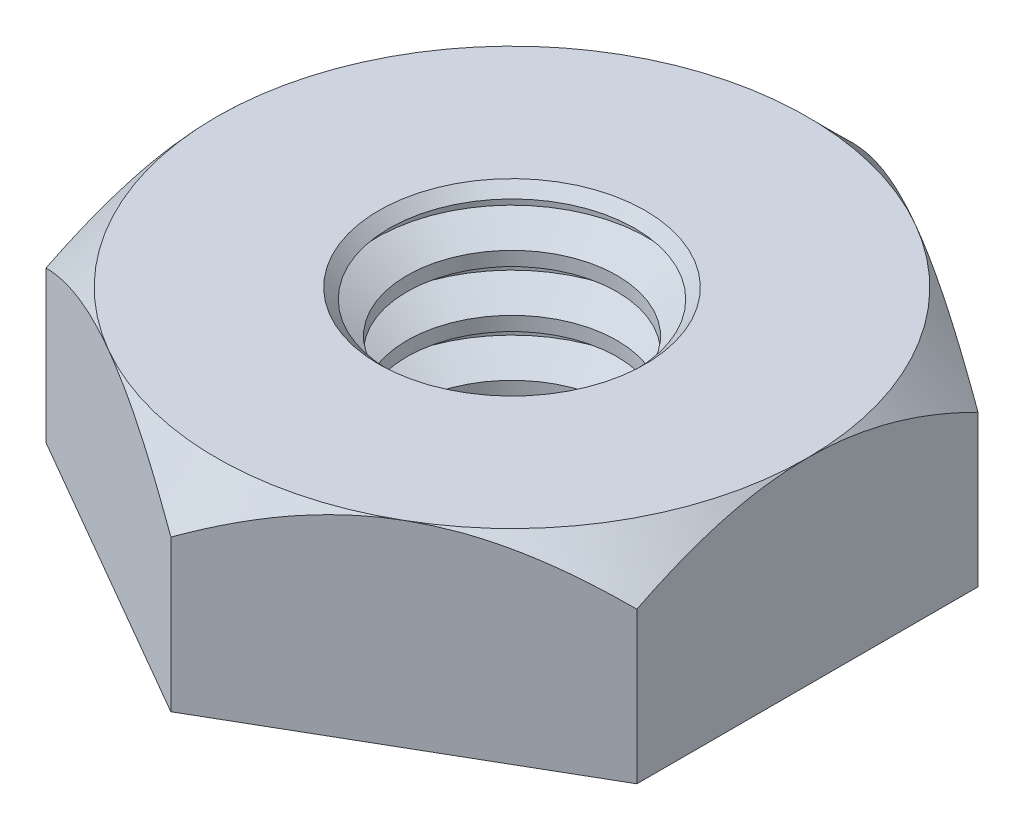
ISO-10303-21;
HEADER;
FILE_DESCRIPTION(('STEP AP214'),'2;1');
FILE_NAME('part.step','',(''),(''),'','','');
FILE_SCHEMA(('AUTOMOTIVE_DESIGN { 1 0 10303 214 1 1 1 1 }'));
ENDSEC;
DATA;
#1=APPLICATION_CONTEXT('core data for automotive mechanical design processes');
#2=APPLICATION_PROTOCOL_DEFINITION('international standard','automotive_design',2000,#1);
#3=PRODUCT_CONTEXT('',#1,'mechanical');
#4=PRODUCT('Part','Part','',(#3));
#5=PRODUCT_RELATED_PRODUCT_CATEGORY('part','',(#4));
#6=PRODUCT_DEFINITION_FORMATION('','',#4);
#7=PRODUCT_DEFINITION_CONTEXT('part definition',#1,'design');
#8=PRODUCT_DEFINITION('design','',#6,#7);
#9=PRODUCT_DEFINITION_SHAPE('','',#8);
#10=(LENGTH_UNIT() NAMED_UNIT(*) SI_UNIT(.MILLI.,.METRE.));
#11=(NAMED_UNIT(*) PLANE_ANGLE_UNIT() SI_UNIT($,.RADIAN.));
#12=(NAMED_UNIT(*) SI_UNIT($,.STERADIAN.) SOLID_ANGLE_UNIT());
#13=UNCERTAINTY_MEASURE_WITH_UNIT(LENGTH_MEASURE(1.E-05),#10,'distance_accuracy_value','');
#14=(GEOMETRIC_REPRESENTATION_CONTEXT(3) GLOBAL_UNCERTAINTY_ASSIGNED_CONTEXT((#13)) GLOBAL_UNIT_ASSIGNED_CONTEXT((#10,
#11,#12)) REPRESENTATION_CONTEXT('',''));
#15=CARTESIAN_POINT('',(0.,0.,0.));
#16=DIRECTION('',(0.,0.,1.));
#17=DIRECTION('',(1.,0.,0.));
#18=AXIS2_PLACEMENT_3D('',#15,#16,#17);
#19=CARTESIAN_POINT('',(0.,0.,-2.7496306570156));
#20=DIRECTION('',(0.,1.,0.));
#21=DIRECTION('',(0.,0.,1.));
#22=AXIS2_PLACEMENT_3D('',#19,#20,#21);
#23=PLANE('',#22);
#24=DIRECTION('',(-0.866025403784439,0.,-0.5));
#25=VECTOR('',#24,1.);
#26=CARTESIAN_POINT('',(2.38125,0.,-1.37481532850781));
#27=LINE('',#26,#25);
#28=CARTESIAN_POINT('',(2.38125,0.,-1.37481532850781));
#29=VERTEX_POINT('',#28);
#30=CARTESIAN_POINT('',(0.,0.,-2.7496306570156));
#31=VERTEX_POINT('',#30);
#32=EDGE_CURVE('E240',#29,#31,#27,.T.);
#33=ORIENTED_EDGE('',*,*,#32,.F.);
#34=DIRECTION('',(0.,0.,-1.));
#35=VECTOR('',#34,1.);
#36=CARTESIAN_POINT('',(2.38125,0.,1.37481532850779));
#37=LINE('',#36,#35);
#38=CARTESIAN_POINT('',(2.38125,0.,1.37481532850779));
#39=VERTEX_POINT('',#38);
#40=EDGE_CURVE('E329',#39,#29,#37,.T.);
#41=ORIENTED_EDGE('',*,*,#40,.F.);
#42=DIRECTION('',(0.866025403784439,0.,-0.5));
#43=VECTOR('',#42,1.);
#44=CARTESIAN_POINT('',(0.,0.,2.74963065701559));
#45=LINE('',#44,#43);
#46=CARTESIAN_POINT('',(0.,0.,2.74963065701559));
#47=VERTEX_POINT('',#46);
#48=EDGE_CURVE('E328',#47,#39,#45,.T.);
#49=ORIENTED_EDGE('',*,*,#48,.F.);
#50=DIRECTION('',(0.866025403784439,0.,0.5));
#51=VECTOR('',#50,1.);
#52=CARTESIAN_POINT('',(-2.38125,0.,1.37481532850779));
#53=LINE('',#52,#51);
#54=CARTESIAN_POINT('',(-2.38125,0.,1.37481532850779));
#55=VERTEX_POINT('',#54);
#56=EDGE_CURVE('E127',#55,#47,#53,.T.);
#57=ORIENTED_EDGE('',*,*,#56,.F.);
#58=DIRECTION('',(0.,0.,1.));
#59=VECTOR('',#58,1.);
#60=CARTESIAN_POINT('',(-2.38125,0.,-1.3748153285078));
#61=LINE('',#60,#59);
#62=CARTESIAN_POINT('',(-2.38125,0.,-1.3748153285078));
#63=VERTEX_POINT('',#62);
#64=EDGE_CURVE('E334',#63,#55,#61,.T.);
#65=ORIENTED_EDGE('',*,*,#64,.F.);
#66=DIRECTION('',(-0.866025403784438,0.,0.500000000000001));
#67=VECTOR('',#66,1.);
#68=CARTESIAN_POINT('',(0.,0.,-2.7496306570156));
#69=LINE('',#68,#67);
#70=EDGE_CURVE('E337',#31,#63,#69,.T.);
#71=ORIENTED_EDGE('',*,*,#70,.F.);
#72=EDGE_LOOP('',(#33,#41,#49,#57,#65,#71));
#73=FACE_BOUND('',#72,.T.);
#74=CARTESIAN_POINT('',(0.,0.,0.));
#75=DIRECTION('',(0.,1.,0.));
#76=DIRECTION('',(0.,0.,1.));
#77=AXIS2_PLACEMENT_3D('',#74,#75,#76);
#78=CIRCLE('',#77,1.04309945255329);
#79=CARTESIAN_POINT('',(0.,0.,1.04309945255329));
#80=VERTEX_POINT('',#79);
#81=EDGE_CURVE('E144',#80,#80,#78,.F.);
#82=ORIENTED_EDGE('',*,*,#81,.F.);
#83=EDGE_LOOP('',(#82));
#84=FACE_BOUND('',#83,.T.);
#85=ADVANCED_FACE('F33',(#73,#84),#23,.F.);
#86=CARTESIAN_POINT('',(0.,1.5875,-2.7496306570156));
#87=DIRECTION('',(0.,1.,0.));
#88=DIRECTION('',(0.,0.,1.));
#89=AXIS2_PLACEMENT_3D('',#86,#87,#88);
#90=PLANE('',#89);
#91=CARTESIAN_POINT('',(0.,1.5875,0.));
#92=DIRECTION('',(0.,1.,0.));
#93=DIRECTION('',(0.,0.,1.));
#94=AXIS2_PLACEMENT_3D('',#91,#92,#93);
#95=CIRCLE('',#94,1.07348297705218);
#96=CARTESIAN_POINT('',(0.,1.5875,1.07348297705218));
#97=VERTEX_POINT('',#96);
#98=EDGE_CURVE('E11',#97,#97,#95,.F.);
#99=ORIENTED_EDGE('',*,*,#98,.T.);
#100=EDGE_LOOP('',(#99));
#101=FACE_BOUND('',#100,.T.);
#102=CARTESIAN_POINT('',(0.,1.5875,0.));
#103=DIRECTION('',(0.,1.,0.));
#104=DIRECTION('',(0.,0.,1.));
#105=AXIS2_PLACEMENT_3D('',#102,#103,#104);
#106=CIRCLE('',#105,2.38125);
#107=CARTESIAN_POINT('',(-1.190625,1.5875,2.06222299276169));
#108=VERTEX_POINT('',#107);
#109=CARTESIAN_POINT('',(1.190625,1.5875,2.06222299276169));
#110=VERTEX_POINT('',#109);
#111=EDGE_CURVE('E109',#108,#110,#106,.T.);
#112=ORIENTED_EDGE('',*,*,#111,.T.);
#113=CARTESIAN_POINT('',(0.,1.5875,0.));
#114=DIRECTION('',(0.,1.,0.));
#115=DIRECTION('',(0.,0.,1.));
#116=AXIS2_PLACEMENT_3D('',#113,#114,#115);
#117=CIRCLE('',#116,2.38125);
#118=CARTESIAN_POINT('',(2.38125,1.5875,0.));
#119=VERTEX_POINT('',#118);
#120=EDGE_CURVE('E49',#110,#119,#117,.T.);
#121=ORIENTED_EDGE('',*,*,#120,.T.);
#122=CARTESIAN_POINT('',(1.190625,1.5875,-2.06222299276169));
#123=VERTEX_POINT('',#122);
#124=EDGE_CURVE('E143',#119,#123,#106,.T.);
#125=ORIENTED_EDGE('',*,*,#124,.T.);
#126=CARTESIAN_POINT('',(-1.190625,1.5875,-2.06222299276169));
#127=VERTEX_POINT('',#126);
#128=EDGE_CURVE('E151',#123,#127,#106,.T.);
#129=ORIENTED_EDGE('',*,*,#128,.T.);
#130=CARTESIAN_POINT('',(-2.38125,1.5875,0.));
#131=VERTEX_POINT('',#130);
#132=EDGE_CURVE('E154',#127,#131,#106,.T.);
#133=ORIENTED_EDGE('',*,*,#132,.T.);
#134=EDGE_CURVE('E142',#131,#108,#106,.T.);
#135=ORIENTED_EDGE('',*,*,#134,.T.);
#136=EDGE_LOOP('',(#112,#121,#125,#129,#133,#135));
#137=FACE_BOUND('',#136,.T.);
#138=ADVANCED_FACE('F161',(#101,#137),#90,.T.);
#139=CARTESIAN_POINT('',(2.38125,1.5875,-1.37481532850781));
#140=DIRECTION('',(-0.5,0.,0.866025403784439));
#141=DIRECTION('',(0.866025403784439,0.,0.5));
#142=AXIS2_PLACEMENT_3D('',#139,#140,#141);
#143=PLANE('',#142);
#144=CARTESIAN_POINT('',(2.38145,1.21900386565717,-1.37469985845397));
#145=CARTESIAN_POINT('',(2.29959321762095,1.26622444627487,-1.42195989379551));
#146=CARTESIAN_POINT('',(2.21636766622824,1.31067176769151,-1.47001018829555));
#147=CARTESIAN_POINT('',(2.04666151916196,1.39205388599882,-1.5679900779874));
#148=CARTESIAN_POINT('',(1.96016478264689,1.42894339988927,-1.61792899209839));
#149=CARTESIAN_POINT('',(1.78574822599095,1.4921359298185,-1.71862843803483));
#150=CARTESIAN_POINT('',(1.69787282881932,1.51859778425492,-1.76936332224702));
#151=CARTESIAN_POINT('',(1.52018740592912,1.55936782736834,-1.87195004898375));
#152=CARTESIAN_POINT('',(1.43038280881412,1.57370645145385,-1.92379875730256));
#153=CARTESIAN_POINT('',(1.27561039686965,1.58664355821429,-2.01315665100182));
#154=CARTESIAN_POINT('',(1.21084255103038,1.58855873833122,-2.05055038423196));
#155=CARTESIAN_POINT('',(1.08141272066442,1.58533272021672,-2.12527673163492));
#156=CARTESIAN_POINT('',(1.01675078120663,1.58018904812731,-2.16260931978719));
#157=CARTESIAN_POINT('',(0.888037451422591,1.56313803211276,-2.2369219953863));
#158=CARTESIAN_POINT('',(0.823986825765133,1.55122312163506,-2.2739016413514));
#159=CARTESIAN_POINT('',(0.696993161094712,1.52128367063236,-2.34722146783424));
#160=CARTESIAN_POINT('',(0.63405003756416,1.50325959846594,-2.38356169714824));
#161=CARTESIAN_POINT('',(0.472823849267805,1.44975053543199,-2.47664568036156));
#162=CARTESIAN_POINT('',(0.37554050871215,1.41023192211222,-2.53281224321903));
#163=CARTESIAN_POINT('',(0.232493937374424,1.3435189994336,-2.61540021968752));
#164=CARTESIAN_POINT('',(0.185353711056031,1.32007913387306,-2.64261664204211));
#165=CARTESIAN_POINT('',(0.0919464736333594,1.27106266632487,-2.69654533571235));
#166=CARTESIAN_POINT('',(0.0456789475031774,1.24548737621755,-2.72325790437834));
#167=CARTESIAN_POINT('',(-0.000199999999999734,1.21900386565717,-2.74974612706944));
#168=B_SPLINE_CURVE_WITH_KNOTS('',3,(#144,#145,#146,#147,#148,#149,#150,#151,#152,#153,#154,
#155,#156,#157,#158,#159,#160,#161,#162,#163,#164,#165,#166,#167),.UNSPECIFIED.,.F.,.F.,(4,2,2,
2,2,2,2,2,2,2,2,4),(0.,0.317196610611949,0.636241461041219,0.950218950629223,1.26340583824126,
1.48752413747844,1.71172100167748,1.93616888974083,2.16059957440838,2.51709639744763,
2.69486147369099,2.87251813383153),.UNSPECIFIED.);
#169=CARTESIAN_POINT('',(2.38125,1.2191193429844,-1.37481532850782));
#170=VERTEX_POINT('',#169);
#171=EDGE_CURVE('E339',#170,#123,#168,.T.);
#172=ORIENTED_EDGE('',*,*,#171,.F.);
#173=DIRECTION('',(0.,-1.,0.));
#174=VECTOR('',#173,1.);
#175=CARTESIAN_POINT('',(2.38125,1.5875,-1.37481532850781));
#176=LINE('',#175,#174);
#177=EDGE_CURVE('E134',#170,#29,#176,.T.);
#178=ORIENTED_EDGE('',*,*,#177,.T.);
#179=ORIENTED_EDGE('',*,*,#32,.T.);
#180=DIRECTION('',(0.,-1.,0.));
#181=VECTOR('',#180,1.);
#182=CARTESIAN_POINT('',(0.,1.5875,-2.7496306570156));
#183=LINE('',#182,#181);
#184=CARTESIAN_POINT('',(0.,1.2191193429844,-2.7496306570156));
#185=VERTEX_POINT('',#184);
#186=EDGE_CURVE('E139',#185,#31,#183,.T.);
#187=ORIENTED_EDGE('',*,*,#186,.F.);
#188=EDGE_CURVE('E212',#123,#185,#168,.T.);
#189=ORIENTED_EDGE('',*,*,#188,.F.);
#190=EDGE_LOOP('',(#172,#178,#179,#187,#189));
#191=FACE_BOUND('',#190,.T.);
#192=ADVANCED_FACE('F35',(#191),#143,.F.);
#193=CARTESIAN_POINT('',(0.,1.5875,-2.7496306570156));
#194=DIRECTION('',(0.500000000000001,0.,0.866025403784438));
#195=DIRECTION('',(0.866025403784438,0.,-0.500000000000001));
#196=AXIS2_PLACEMENT_3D('',#193,#194,#195);
#197=PLANE('',#196);
#198=CARTESIAN_POINT('',(0.000200000000000166,1.21900386565717,-2.74974612706944));
#199=CARTESIAN_POINT('',(-0.0816567823790508,1.26622444627487,-2.7024860917279));
#200=CARTESIAN_POINT('',(-0.164882333771762,1.31067176769151,-2.65443579722786));
#201=CARTESIAN_POINT('',(-0.334588480838043,1.39205388599882,-2.55645590753601));
#202=CARTESIAN_POINT('',(-0.421085217353107,1.42894339988927,-2.50651699342501));
#203=CARTESIAN_POINT('',(-0.595501774009049,1.49213592981849,-2.40581754748858));
#204=CARTESIAN_POINT('',(-0.683377171180682,1.51859778425492,-2.35508266327639));
#205=CARTESIAN_POINT('',(-0.861062594070885,1.55936782736834,-2.25249593653966));
#206=CARTESIAN_POINT('',(-0.950867191185882,1.57370645145385,-2.20064722822085));
#207=CARTESIAN_POINT('',(-1.10563960313035,1.58664355821429,-2.11128933452158));
#208=CARTESIAN_POINT('',(-1.17040744896963,1.58855873833122,-2.07389560129144));
#209=CARTESIAN_POINT('',(-1.29983727933559,1.58533272021672,-1.99916925388849));
#210=CARTESIAN_POINT('',(-1.36449921879337,1.58018904812731,-1.96183666573621));
#211=CARTESIAN_POINT('',(-1.49321254857742,1.56313803211276,-1.8875239901371));
#212=CARTESIAN_POINT('',(-1.55726317423487,1.55122312163507,-1.85054434417201));
#213=CARTESIAN_POINT('',(-1.68425683890529,1.52128367063237,-1.77722451768916));
#214=CARTESIAN_POINT('',(-1.74719996243585,1.50325959846595,-1.74088428837516));
#215=CARTESIAN_POINT('',(-1.9084261507322,1.44975053543199,-1.64780030516184));
#216=CARTESIAN_POINT('',(-2.00570949128785,1.41023192211222,-1.59163374230437));
#217=CARTESIAN_POINT('',(-2.14875606262558,1.3435189994336,-1.50904576583588));
#218=CARTESIAN_POINT('',(-2.19589628894397,1.32007913387307,-1.4818293434813));
#219=CARTESIAN_POINT('',(-2.28930352636664,1.27106266632487,-1.42790064981106));
#220=CARTESIAN_POINT('',(-2.33557105249682,1.24548737621755,-1.40118808114506));
#221=CARTESIAN_POINT('',(-2.38145,1.21900386565717,-1.37469985845397));
#222=B_SPLINE_CURVE_WITH_KNOTS('',3,(#198,#199,#200,#201,#202,#203,#204,#205,#206,#207,#208,
#209,#210,#211,#212,#213,#214,#215,#216,#217,#218,#219,#220,#221),.UNSPECIFIED.,.F.,.F.,(4,2,2,
2,2,2,2,2,2,2,2,4),(0.,0.317196610611952,0.636241461041225,0.950218950629232,1.26340583824127,
1.48752413747846,1.71172100167749,1.93616888974084,2.16059957440839,2.51709639744764,
2.694861473691,2.87251813383154),.UNSPECIFIED.);
#223=EDGE_CURVE('E211',#185,#127,#222,.T.);
#224=ORIENTED_EDGE('',*,*,#223,.F.);
#225=ORIENTED_EDGE('',*,*,#186,.T.);
#226=ORIENTED_EDGE('',*,*,#70,.T.);
#227=DIRECTION('',(0.,-1.,0.));
#228=VECTOR('',#227,1.);
#229=CARTESIAN_POINT('',(-2.38125,1.5875,-1.3748153285078));
#230=LINE('',#229,#228);
#231=CARTESIAN_POINT('',(-2.38125,1.2191193429844,-1.37481532850781));
#232=VERTEX_POINT('',#231);
#233=EDGE_CURVE('E132',#232,#63,#230,.T.);
#234=ORIENTED_EDGE('',*,*,#233,.F.);
#235=EDGE_CURVE('E207',#127,#232,#222,.T.);
#236=ORIENTED_EDGE('',*,*,#235,.F.);
#237=EDGE_LOOP('',(#224,#225,#226,#234,#236));
#238=FACE_BOUND('',#237,.T.);
#239=ADVANCED_FACE('F217',(#238),#197,.F.);
#240=CARTESIAN_POINT('',(-2.38125,1.5875,-1.3748153285078));
#241=DIRECTION('',(1.,0.,0.));
#242=DIRECTION('',(0.,0.,-1.));
#243=AXIS2_PLACEMENT_3D('',#240,#241,#242);
#244=PLANE('',#243);
#245=CARTESIAN_POINT('',(-2.38125,0.240179588906181,-2.86912630394419));
#246=CARTESIAN_POINT('',(-2.38125,0.293506689126681,-2.79980955592461));
#247=CARTESIAN_POINT('',(-2.38125,0.346355938633444,-2.7301193164531));
#248=CARTESIAN_POINT('',(-2.38125,0.450880424075711,-2.58983919614982));
#249=CARTESIAN_POINT('',(-2.38125,0.502555379296196,-2.51924910637501));
#250=CARTESIAN_POINT('',(-2.38125,0.604880705975389,-2.37650077502422));
#251=CARTESIAN_POINT('',(-2.38125,0.655520097364171,-2.30433463685783));
#252=CARTESIAN_POINT('',(-2.38125,0.755036614291812,-2.15880130547659));
#253=CARTESIAN_POINT('',(-2.38125,0.803913861173311,-2.08543419546942));
#254=CARTESIAN_POINT('',(-2.38125,0.902542961805656,-1.93258845780627));
#255=CARTESIAN_POINT('',(-2.38125,0.952152910200805,-1.85301779850509));
#256=CARTESIAN_POINT('',(-2.38125,1.04827866709485,-1.69203159559179));
#257=CARTESIAN_POINT('',(-2.38125,1.09479487864361,-1.61061629415846));
#258=CARTESIAN_POINT('',(-2.38125,1.18376557525143,-1.44588343133112));
#259=CARTESIAN_POINT('',(-2.38125,1.22623141970181,-1.36257205340724));
#260=CARTESIAN_POINT('',(-2.38125,1.30614212570996,-1.19359416640859));
#261=CARTESIAN_POINT('',(-2.38125,1.34358935588907,-1.10792879151245));
#262=CARTESIAN_POINT('',(-2.38125,1.40872452306872,-0.942635039086768));
#263=CARTESIAN_POINT('',(-2.38125,1.4370108001417,-0.86324486347623));
#264=CARTESIAN_POINT('',(-2.38125,1.48722865765993,-0.702441892782966));
#265=CARTESIAN_POINT('',(-2.38125,1.50915983334739,-0.621028969229365));
#266=CARTESIAN_POINT('',(-2.38125,1.54511481952273,-0.458084644425686));
#267=CARTESIAN_POINT('',(-2.38125,1.55928224783569,-0.376585475438002));
#268=CARTESIAN_POINT('',(-2.38125,1.57941416514849,-0.212574622282762));
#269=CARTESIAN_POINT('',(-2.38125,1.5853803560254,-0.1300631517693));
#270=CARTESIAN_POINT('',(-2.38125,1.58860164225672,0.031522259858205));
#271=CARTESIAN_POINT('',(-2.38125,1.58622590278112,0.110588903174689));
#272=CARTESIAN_POINT('',(-2.38125,1.5737417806567,0.268104622589961));
#273=CARTESIAN_POINT('',(-2.38125,1.56363269564102,0.346553641940321));
#274=CARTESIAN_POINT('',(-2.38125,1.53608239112472,0.503598587723649));
#275=CARTESIAN_POINT('',(-2.38125,1.51851172190116,0.582171453187212));
#276=CARTESIAN_POINT('',(-2.38125,1.47701024838173,0.737578750449081));
#277=CARTESIAN_POINT('',(-2.38125,1.45307980531335,0.814413280713858));
#278=CARTESIAN_POINT('',(-2.38125,1.37028997046201,1.05086897592276));
#279=CARTESIAN_POINT('',(-2.38125,1.30223450438981,1.20728049738153));
#280=CARTESIAN_POINT('',(-2.38125,1.18870821735986,1.43619844948697));
#281=CARTESIAN_POINT('',(-2.38125,1.14887086566416,1.51169480576284));
#282=CARTESIAN_POINT('',(-2.38125,1.0661066438325,1.6609787360797));
#283=CARTESIAN_POINT('',(-2.38125,1.02318031702828,1.73476660762932));
#284=CARTESIAN_POINT('',(-2.38125,0.937038433864163,1.87722638325708));
#285=CARTESIAN_POINT('',(-2.38125,0.893941790031278,1.94597101003489));
#286=CARTESIAN_POINT('',(-2.38125,0.805912978151154,2.08228069367819));
#287=CARTESIAN_POINT('',(-2.38125,0.760980672486613,2.14984566156212));
#288=CARTESIAN_POINT('',(-2.38125,0.669974823916356,2.2834054266231));
#289=CARTESIAN_POINT('',(-2.38125,0.62391334034527,2.34940847508033));
#290=CARTESIAN_POINT('',(-2.38125,0.53055562575305,2.48050909903297));
#291=CARTESIAN_POINT('',(-2.38125,0.483259738608898,2.54560691911997));
#292=CARTESIAN_POINT('',(-2.38125,0.435458445142948,2.61032519987917));
#293=B_SPLINE_CURVE_WITH_KNOTS('',3,(#245,#246,#247,#248,#249,#250,#251,#252,#253,#254,#255,
#256,#257,#258,#259,#260,#261,#262,#263,#264,#265,#266,#267,#268,#269,#270,#271,#272,#273,#274,
#275,#276,#277,#278,#279,#280,#281,#282,#283,#284,#285,#286,#287,#288,#289,#290,#291,#292),
.UNSPECIFIED.,.F.,.F.,(4,2,2,2,2,2,2,2,2,2,2,2,2,2,2,2,2,2,2,2,2,2,2,4),(0.,0.262373486076588,
0.524809046422166,0.789269246638219,1.05371120100018,1.33496294182564,1.61617796930576,
1.89657958024649,2.17684838122958,2.42946682102386,2.68210134660699,2.92988953986813,
3.17762630567771,3.41454048769348,3.65147618955809,3.89270212574338,4.13391436351259,
4.64406226241705,4.90012722407799,5.15614725506489,5.39952730752342,5.64292563948722,
5.88436975409123,6.12574731099199),.UNSPECIFIED.);
#294=EDGE_CURVE('E166',#232,#131,#293,.T.);
#295=ORIENTED_EDGE('',*,*,#294,.F.);
#296=ORIENTED_EDGE('',*,*,#233,.T.);
#297=ORIENTED_EDGE('',*,*,#64,.T.);
#298=DIRECTION('',(0.,-1.,0.));
#299=VECTOR('',#298,1.);
#300=CARTESIAN_POINT('',(-2.38125,1.5875,1.37481532850779));
#301=LINE('',#300,#299);
#302=CARTESIAN_POINT('',(-2.38125000000002,1.2191193429844,1.37481532850778));
#303=VERTEX_POINT('',#302);
#304=EDGE_CURVE('E129',#303,#55,#301,.T.);
#305=ORIENTED_EDGE('',*,*,#304,.F.);
#306=EDGE_CURVE('E164',#131,#303,#293,.T.);
#307=ORIENTED_EDGE('',*,*,#306,.F.);
#308=EDGE_LOOP('',(#295,#296,#297,#305,#307));
#309=FACE_BOUND('',#308,.T.);
#310=ADVANCED_FACE('F220',(#309),#244,.F.);
#311=CARTESIAN_POINT('',(-2.38125,1.5875,1.37481532850779));
#312=DIRECTION('',(0.5,0.,-0.866025403784439));
#313=DIRECTION('',(-0.866025403784439,0.,-0.5));
#314=AXIS2_PLACEMENT_3D('',#311,#312,#313);
#315=PLANE('',#314);
#316=CARTESIAN_POINT('',(-2.38145,1.21900386565718,1.37469985845395));
#317=CARTESIAN_POINT('',(-2.29959321762095,1.26622444627488,1.4219598937955));
#318=CARTESIAN_POINT('',(-2.21636766622824,1.31067176769152,1.47001018829553));
#319=CARTESIAN_POINT('',(-2.04666151916196,1.39205388599883,1.56799007798738));
#320=CARTESIAN_POINT('',(-1.9601647826469,1.42894339988927,1.61792899209838));
#321=CARTESIAN_POINT('',(-1.78574822599096,1.4921359298185,1.71862843803482));
#322=CARTESIAN_POINT('',(-1.69787282881932,1.51859778425493,1.769363322247));
#323=CARTESIAN_POINT('',(-1.52018740592912,1.55936782736835,1.87195004898373));
#324=CARTESIAN_POINT('',(-1.43038280881412,1.57370645145386,1.92379875730254));
#325=CARTESIAN_POINT('',(-1.27561039686965,1.5866435582143,2.01315665100181));
#326=CARTESIAN_POINT('',(-1.21084255103038,1.58855873833123,2.05055038423195));
#327=CARTESIAN_POINT('',(-1.08141272066442,1.58533272021673,2.1252767316349));
#328=CARTESIAN_POINT('',(-1.01675078120664,1.58018904812732,2.16260931978718));
#329=CARTESIAN_POINT('',(-0.888037451422593,1.56313803211277,2.23692199538629));
#330=CARTESIAN_POINT('',(-0.823986825765135,1.55122312163508,2.27390164135138));
#331=CARTESIAN_POINT('',(-0.696993161094714,1.52128367063238,2.34722146783423));
#332=CARTESIAN_POINT('',(-0.634050037564163,1.50325959846596,2.38356169714823));
#333=CARTESIAN_POINT('',(-0.472823849267807,1.449750535432,2.47664568036155));
#334=CARTESIAN_POINT('',(-0.375540508712152,1.41023192211223,2.53281224321902));
#335=CARTESIAN_POINT('',(-0.232493937374426,1.34351899943361,2.61540021968751));
#336=CARTESIAN_POINT('',(-0.185353711056032,1.32007913387308,2.64261664204209));
#337=CARTESIAN_POINT('',(-0.0919464736333602,1.27106266632488,2.69654533571233));
#338=CARTESIAN_POINT('',(-0.045678947503178,1.24548737621756,2.72325790437833));
#339=CARTESIAN_POINT('',(0.000199999999999358,1.21900386565718,2.74974612706943));
#340=B_SPLINE_CURVE_WITH_KNOTS('',3,(#316,#317,#318,#319,#320,#321,#322,#323,#324,#325,#326,
#327,#328,#329,#330,#331,#332,#333,#334,#335,#336,#337,#338,#339),.UNSPECIFIED.,.F.,.F.,(4,2,2,
2,2,2,2,2,2,2,2,4),(0.,0.317196610611951,0.636241461041222,0.950218950629227,1.26340583824127,
1.48752413747845,1.71172100167748,1.93616888974083,2.16059957440838,2.51709639744764,
2.69486147369099,2.87251813383154),.UNSPECIFIED.);
#341=EDGE_CURVE('E114',#303,#108,#340,.T.);
#342=ORIENTED_EDGE('',*,*,#341,.F.);
#343=ORIENTED_EDGE('',*,*,#304,.T.);
#344=ORIENTED_EDGE('',*,*,#56,.T.);
#345=DIRECTION('',(0.,-1.,0.));
#346=VECTOR('',#345,1.);
#347=CARTESIAN_POINT('',(0.,1.5875,2.74963065701559));
#348=LINE('',#347,#346);
#349=CARTESIAN_POINT('',(0.,1.2191193429844,2.7496306570156));
#350=VERTEX_POINT('',#349);
#351=EDGE_CURVE('E120',#350,#47,#348,.T.);
#352=ORIENTED_EDGE('',*,*,#351,.F.);
#353=EDGE_CURVE('E105',#108,#350,#340,.T.);
#354=ORIENTED_EDGE('',*,*,#353,.F.);
#355=EDGE_LOOP('',(#342,#343,#344,#352,#354));
#356=FACE_BOUND('',#355,.T.);
#357=ADVANCED_FACE('F125',(#356),#315,.F.);
#358=CARTESIAN_POINT('',(0.,1.5875,2.74963065701559));
#359=DIRECTION('',(-0.5,0.,-0.866025403784439));
#360=DIRECTION('',(-0.866025403784439,0.,0.5));
#361=AXIS2_PLACEMENT_3D('',#358,#359,#360);
#362=PLANE('',#361);
#363=CARTESIAN_POINT('',(-0.000200000000000334,1.21900386565718,2.74974612706943));
#364=CARTESIAN_POINT('',(0.0816567823790502,1.26622444627488,2.70248609172789));
#365=CARTESIAN_POINT('',(0.164882333771761,1.31067176769152,2.65443579722785));
#366=CARTESIAN_POINT('',(0.334588480838041,1.39205388599883,2.556455907536));
#367=CARTESIAN_POINT('',(0.421085217353105,1.42894339988928,2.506516993425));
#368=CARTESIAN_POINT('',(0.595501774009046,1.49213592981851,2.40581754748857));
#369=CARTESIAN_POINT('',(0.683377171180678,1.51859778425493,2.35508266327638));
#370=CARTESIAN_POINT('',(0.86106259407088,1.55936782736835,2.25249593653965));
#371=CARTESIAN_POINT('',(0.950867191185876,1.57370645145386,2.20064722822084));
#372=CARTESIAN_POINT('',(1.10563960313035,1.5866435582143,2.11128933452157));
#373=CARTESIAN_POINT('',(1.17040744896962,1.58855873833123,2.07389560129143));
#374=CARTESIAN_POINT('',(1.29983727933558,1.58533272021673,1.99916925388848));
#375=CARTESIAN_POINT('',(1.36449921879336,1.58018904812732,1.96183666573621));
#376=CARTESIAN_POINT('',(1.49321254857741,1.56313803211277,1.8875239901371));
#377=CARTESIAN_POINT('',(1.55726317423487,1.55122312163508,1.850544344172));
#378=CARTESIAN_POINT('',(1.68425683890529,1.52128367063238,1.77722451768916));
#379=CARTESIAN_POINT('',(1.74719996243584,1.50325959846596,1.74088428837516));
#380=CARTESIAN_POINT('',(1.90842615073219,1.449750535432,1.64780030516184));
#381=CARTESIAN_POINT('',(2.00570949128785,1.41023192211223,1.59163374230436));
#382=CARTESIAN_POINT('',(2.14875606262557,1.34351899943361,1.50904576583587));
#383=CARTESIAN_POINT('',(2.19589628894397,1.32007913387308,1.48182934348129));
#384=CARTESIAN_POINT('',(2.28930352636664,1.27106266632488,1.42790064981105));
#385=CARTESIAN_POINT('',(2.33557105249682,1.24548737621756,1.40118808114505));
#386=CARTESIAN_POINT('',(2.38145,1.21900386565718,1.37469985845396));
#387=B_SPLINE_CURVE_WITH_KNOTS('',3,(#363,#364,#365,#366,#367,#368,#369,#370,#371,#372,#373,
#374,#375,#376,#377,#378,#379,#380,#381,#382,#383,#384,#385,#386),.UNSPECIFIED.,.F.,.F.,(4,2,2,
2,2,2,2,2,2,2,2,4),(0.,0.31719661061195,0.636241461041222,0.950218950629226,1.26340583824126,
1.48752413747845,1.71172100167748,1.93616888974083,2.16059957440838,2.51709639744763,
2.69486147369099,2.87251813383153),.UNSPECIFIED.);
#388=EDGE_CURVE('E108',#350,#110,#387,.T.);
#389=ORIENTED_EDGE('',*,*,#388,.F.);
#390=ORIENTED_EDGE('',*,*,#351,.T.);
#391=ORIENTED_EDGE('',*,*,#48,.T.);
#392=DIRECTION('',(0.,-1.,0.));
#393=VECTOR('',#392,1.);
#394=CARTESIAN_POINT('',(2.38125,1.5875,1.37481532850779));
#395=LINE('',#394,#393);
#396=CARTESIAN_POINT('',(2.38125,1.2191193429844,1.37481532850782));
#397=VERTEX_POINT('',#396);
#398=EDGE_CURVE('E130',#397,#39,#395,.T.);
#399=ORIENTED_EDGE('',*,*,#398,.F.);
#400=EDGE_CURVE('E123',#110,#397,#387,.T.);
#401=ORIENTED_EDGE('',*,*,#400,.F.);
#402=EDGE_LOOP('',(#389,#390,#391,#399,#401));
#403=FACE_BOUND('',#402,.T.);
#404=ADVANCED_FACE('F118',(#403),#362,.F.);
#405=CARTESIAN_POINT('',(2.38125,1.5875,1.37481532850779));
#406=DIRECTION('',(-1.,0.,0.));
#407=DIRECTION('',(0.,0.,1.));
#408=AXIS2_PLACEMENT_3D('',#405,#406,#407);
#409=PLANE('',#408);
#410=CARTESIAN_POINT('',(2.38125,0.240179588906176,-2.8691263039442));
#411=CARTESIAN_POINT('',(2.38125,0.293506689126676,-2.79980955592462));
#412=CARTESIAN_POINT('',(2.38125,0.346355938633439,-2.73011931645311));
#413=CARTESIAN_POINT('',(2.38125,0.450880424075706,-2.58983919614982));
#414=CARTESIAN_POINT('',(2.38125,0.502555379296192,-2.51924910637502));
#415=CARTESIAN_POINT('',(2.38125,0.604880705975386,-2.37650077502423));
#416=CARTESIAN_POINT('',(2.38125,0.655520097364168,-2.30433463685784));
#417=CARTESIAN_POINT('',(2.38125,0.755036614291809,-2.1588013054766));
#418=CARTESIAN_POINT('',(2.38125,0.803913861173308,-2.08543419546942));
#419=CARTESIAN_POINT('',(2.38125,0.902542961805654,-1.93258845780627));
#420=CARTESIAN_POINT('',(2.38125,0.952152910200804,-1.8530177985051));
#421=CARTESIAN_POINT('',(2.38125,1.04827866709485,-1.69203159559179));
#422=CARTESIAN_POINT('',(2.38125,1.09479487864361,-1.61061629415846));
#423=CARTESIAN_POINT('',(2.38125,1.18376557525143,-1.44588343133113));
#424=CARTESIAN_POINT('',(2.38125,1.22623141970181,-1.36257205340725));
#425=CARTESIAN_POINT('',(2.38125,1.30614212570997,-1.19359416640859));
#426=CARTESIAN_POINT('',(2.38125,1.34358935588908,-1.10792879151245));
#427=CARTESIAN_POINT('',(2.38125,1.40872452306873,-0.942635039086772));
#428=CARTESIAN_POINT('',(2.38125,1.43701080014171,-0.863244863476234));
#429=CARTESIAN_POINT('',(2.38125,1.48722865765993,-0.70244189278297));
#430=CARTESIAN_POINT('',(2.38125,1.50915983334739,-0.621028969229369));
#431=CARTESIAN_POINT('',(2.38125,1.54511481952273,-0.45808464442569));
#432=CARTESIAN_POINT('',(2.38125,1.55928224783569,-0.376585475438006));
#433=CARTESIAN_POINT('',(2.38125,1.57941416514849,-0.212574622282766));
#434=CARTESIAN_POINT('',(2.38125,1.58538035602541,-0.130063151769303));
#435=CARTESIAN_POINT('',(2.38125,1.58860164225672,0.0315222598582019));
#436=CARTESIAN_POINT('',(2.38125,1.58622590278112,0.110588903174686));
#437=CARTESIAN_POINT('',(2.38125,1.5737417806567,0.268104622589958));
#438=CARTESIAN_POINT('',(2.38125,1.56363269564102,0.346553641940318));
#439=CARTESIAN_POINT('',(2.38125,1.53608239112472,0.503598587723646));
#440=CARTESIAN_POINT('',(2.38125,1.51851172190117,0.58217145318721));
#441=CARTESIAN_POINT('',(2.38125,1.47701024838173,0.737578750449078));
#442=CARTESIAN_POINT('',(2.38125,1.45307980531336,0.814413280713856));
#443=CARTESIAN_POINT('',(2.38125,1.37028997046202,1.05086897592276));
#444=CARTESIAN_POINT('',(2.38125,1.30223450438981,1.20728049738153));
#445=CARTESIAN_POINT('',(2.38125,1.18870821735987,1.43619844948697));
#446=CARTESIAN_POINT('',(2.38125,1.14887086566416,1.51169480576284));
#447=CARTESIAN_POINT('',(2.38125,1.06610664383251,1.66097873607969));
#448=CARTESIAN_POINT('',(2.38125,1.02318031702829,1.73476660762932));
#449=CARTESIAN_POINT('',(2.38125,0.93703843386417,1.87722638325707));
#450=CARTESIAN_POINT('',(2.38125,0.893941790031285,1.94597101003488));
#451=CARTESIAN_POINT('',(2.38125,0.805912978151162,2.08228069367818));
#452=CARTESIAN_POINT('',(2.38125,0.76098067248662,2.14984566156211));
#453=CARTESIAN_POINT('',(2.38125,0.669974823916364,2.28340542662309));
#454=CARTESIAN_POINT('',(2.38125,0.623913340345278,2.34940847508032));
#455=CARTESIAN_POINT('',(2.38125,0.530555625753058,2.48050909903296));
#456=CARTESIAN_POINT('',(2.38125,0.483259738608906,2.54560691911996));
#457=CARTESIAN_POINT('',(2.38125,0.435458445142958,2.61032519987917));
#458=B_SPLINE_CURVE_WITH_KNOTS('',3,(#410,#411,#412,#413,#414,#415,#416,#417,#418,#419,#420,
#421,#422,#423,#424,#425,#426,#427,#428,#429,#430,#431,#432,#433,#434,#435,#436,#437,#438,#439,
#440,#441,#442,#443,#444,#445,#446,#447,#448,#449,#450,#451,#452,#453,#454,#455,#456,#457),
.UNSPECIFIED.,.F.,.F.,(4,2,2,2,2,2,2,2,2,2,2,2,2,2,2,2,2,2,2,2,2,2,2,4),(0.,0.26237348607659,
0.524809046422169,0.789269246638222,1.05371120100018,1.33496294182565,1.61617796930576,
1.8965795802465,2.17684838122959,2.42946682102387,2.682101346607,2.92988953986814,
3.17762630567772,3.41454048769349,3.6514761895581,3.89270212574339,4.1339143635126,
4.64406226241706,4.900127224078,5.1561472550649,5.39952730752343,5.64292563948723,
5.88436975409124,6.125747310992),.UNSPECIFIED.);
#459=EDGE_CURVE('E320',#397,#119,#458,.F.);
#460=ORIENTED_EDGE('',*,*,#459,.F.);
#461=ORIENTED_EDGE('',*,*,#398,.T.);
#462=ORIENTED_EDGE('',*,*,#40,.T.);
#463=ORIENTED_EDGE('',*,*,#177,.F.);
#464=EDGE_CURVE('E197',#119,#170,#458,.F.);
#465=ORIENTED_EDGE('',*,*,#464,.F.);
#466=EDGE_LOOP('',(#460,#461,#462,#463,#465));
#467=FACE_BOUND('',#466,.T.);
#468=ADVANCED_FACE('F325',(#467),#409,.F.);
#469=CARTESIAN_POINT('',(0.,1.5875,0.));
#470=DIRECTION('',(0.,-1.,0.));
#471=DIRECTION('',(0.,0.,-1.));
#472=AXIS2_PLACEMENT_3D('',#469,#470,#471);
#473=CONICAL_SURFACE('',#472,2.38125,0.785398163397455);
#474=ORIENTED_EDGE('',*,*,#353,.T.);
#475=ORIENTED_EDGE('',*,*,#388,.T.);
#476=ORIENTED_EDGE('',*,*,#111,.F.);
#477=EDGE_LOOP('',(#474,#475,#476));
#478=FACE_BOUND('',#477,.T.);
#479=ADVANCED_FACE('F107',(#478),#473,.T.);
#480=ORIENTED_EDGE('',*,*,#306,.T.);
#481=ORIENTED_EDGE('',*,*,#341,.T.);
#482=ORIENTED_EDGE('',*,*,#134,.F.);
#483=EDGE_LOOP('',(#480,#481,#482));
#484=FACE_BOUND('',#483,.T.);
#485=ADVANCED_FACE('F163',(#484),#473,.T.);
#486=ORIENTED_EDGE('',*,*,#235,.T.);
#487=ORIENTED_EDGE('',*,*,#294,.T.);
#488=ORIENTED_EDGE('',*,*,#132,.F.);
#489=EDGE_LOOP('',(#486,#487,#488));
#490=FACE_BOUND('',#489,.T.);
#491=ADVANCED_FACE('F345',(#490),#473,.T.);
#492=ORIENTED_EDGE('',*,*,#188,.T.);
#493=ORIENTED_EDGE('',*,*,#223,.T.);
#494=ORIENTED_EDGE('',*,*,#128,.F.);
#495=EDGE_LOOP('',(#492,#493,#494));
#496=FACE_BOUND('',#495,.T.);
#497=ADVANCED_FACE('F190',(#496),#473,.T.);
#498=ORIENTED_EDGE('',*,*,#171,.T.);
#499=ORIENTED_EDGE('',*,*,#124,.F.);
#500=ORIENTED_EDGE('',*,*,#464,.T.);
#501=EDGE_LOOP('',(#498,#499,#500));
#502=FACE_BOUND('',#501,.T.);
#503=ADVANCED_FACE('F184',(#502),#473,.T.);
#504=ORIENTED_EDGE('',*,*,#400,.T.);
#505=ORIENTED_EDGE('',*,*,#459,.T.);
#506=ORIENTED_EDGE('',*,*,#120,.F.);
#507=EDGE_LOOP('',(#504,#505,#506));
#508=FACE_BOUND('',#507,.T.);
#509=ADVANCED_FACE('F189',(#508),#473,.T.);
#510=CARTESIAN_POINT('',(0.,1.44575892857143,0.));
#511=DIRECTION('',(0.,-1.,0.));
#512=DIRECTION('',(0.,0.,-1.));
#513=AXIS2_PLACEMENT_3D('',#510,#511,#512);
#514=CONICAL_SURFACE('',#513,1.0922,1.0471975511966);
#515=CARTESIAN_POINT('',(0.,1.50449066735603,0.));
#516=DIRECTION('',(0.,1.,0.));
#517=DIRECTION('',(0.,0.,1.));
#518=AXIS2_PLACEMENT_3D('',#515,#516,#517);
#519=CIRCLE('',#518,0.990473644408207);
#520=CARTESIAN_POINT('',(0.,1.50449066735603,0.990473644408207));
#521=VERTEX_POINT('',#520);
#522=EDGE_CURVE('E42',#521,#521,#519,.T.);
#523=ORIENTED_EDGE('',*,*,#522,.T.);
#524=EDGE_LOOP('',(#523));
#525=FACE_BOUND('',#524,.T.);
#526=CARTESIAN_POINT('',(0.,1.44575892857143,0.));
#527=DIRECTION('',(0.,1.,0.));
#528=DIRECTION('',(0.,0.,1.));
#529=AXIS2_PLACEMENT_3D('',#526,#527,#528);
#530=CIRCLE('',#529,1.0922);
#531=CARTESIAN_POINT('',(0.,1.44575892857143,1.0922));
#532=VERTEX_POINT('',#531);
#533=EDGE_CURVE('E309',#532,#532,#530,.T.);
#534=ORIENTED_EDGE('',*,*,#533,.F.);
#535=EDGE_LOOP('',(#534));
#536=FACE_BOUND('',#535,.T.);
#537=ADVANCED_FACE('F192',(#525,#536),#514,.F.);
#538=CARTESIAN_POINT('',(0.,1.66357854098429,0.));
#539=DIRECTION('',(0.,1.,0.));
#540=DIRECTION('',(0.,0.,1.));
#541=AXIS2_PLACEMENT_3D('',#538,#539,#540);
#542=CYLINDRICAL_SURFACE('',#541,1.0922);
#543=ORIENTED_EDGE('',*,*,#533,.T.);
#544=EDGE_LOOP('',(#543));
#545=FACE_BOUND('',#544,.T.);
#546=CARTESIAN_POINT('',(0.,1.3890625,0.));
#547=DIRECTION('',(0.,1.,0.));
#548=DIRECTION('',(0.,0.,1.));
#549=AXIS2_PLACEMENT_3D('',#546,#547,#548);
#550=CIRCLE('',#549,1.0922);
#551=CARTESIAN_POINT('',(0.,1.3890625,1.0922));
#552=VERTEX_POINT('',#551);
#553=EDGE_CURVE('E312',#552,#552,#550,.T.);
#554=ORIENTED_EDGE('',*,*,#553,.F.);
#555=EDGE_LOOP('',(#554));
#556=FACE_BOUND('',#555,.T.);
#557=ADVANCED_FACE('F299',(#545,#556),#542,.F.);
#558=CARTESIAN_POINT('',(0.,1.24732142857143,0.));
#559=DIRECTION('',(0.,1.,0.));
#560=DIRECTION('',(0.,0.,1.));
#561=AXIS2_PLACEMENT_3D('',#558,#559,#560);
#562=CONICAL_SURFACE('',#561,0.846697262766464,1.0471975511966);
#563=ORIENTED_EDGE('',*,*,#553,.T.);
#564=EDGE_LOOP('',(#563));
#565=FACE_BOUND('',#564,.T.);
#566=CARTESIAN_POINT('',(0.,1.24732142857143,0.));
#567=DIRECTION('',(0.,1.,0.));
#568=DIRECTION('',(0.,0.,1.));
#569=AXIS2_PLACEMENT_3D('',#566,#567,#568);
#570=CIRCLE('',#569,0.846697262766464);
#571=CARTESIAN_POINT('',(0.,1.24732142857143,0.846697262766464));
#572=VERTEX_POINT('',#571);
#573=EDGE_CURVE('E313',#572,#572,#570,.T.);
#574=ORIENTED_EDGE('',*,*,#573,.F.);
#575=EDGE_LOOP('',(#574));
#576=FACE_BOUND('',#575,.T.);
#577=ADVANCED_FACE('F296',(#565,#576),#562,.F.);
#578=CARTESIAN_POINT('',(0.,1.66357854098429,0.));
#579=DIRECTION('',(0.,1.,0.));
#580=DIRECTION('',(0.,0.,1.));
#581=AXIS2_PLACEMENT_3D('',#578,#579,#580);
#582=CYLINDRICAL_SURFACE('',#581,0.846697262766464);
#583=ORIENTED_EDGE('',*,*,#573,.T.);
#584=EDGE_LOOP('',(#583));
#585=FACE_BOUND('',#584,.T.);
#586=CARTESIAN_POINT('',(0.,1.13392857142857,0.));
#587=DIRECTION('',(0.,1.,0.));
#588=DIRECTION('',(0.,0.,1.));
#589=AXIS2_PLACEMENT_3D('',#586,#587,#588);
#590=CIRCLE('',#589,0.846697262766464);
#591=CARTESIAN_POINT('',(0.,1.13392857142857,0.846697262766464));
#592=VERTEX_POINT('',#591);
#593=EDGE_CURVE('E317',#592,#592,#590,.T.);
#594=ORIENTED_EDGE('',*,*,#593,.F.);
#595=EDGE_LOOP('',(#594));
#596=FACE_BOUND('',#595,.T.);
#597=ADVANCED_FACE('F292',(#585,#596),#582,.F.);
#598=CARTESIAN_POINT('',(0.,0.9921875,0.));
#599=DIRECTION('',(0.,-1.,0.));
#600=DIRECTION('',(0.,0.,-1.));
#601=AXIS2_PLACEMENT_3D('',#598,#599,#600);
#602=CONICAL_SURFACE('',#601,1.0922,1.0471975511966);
#603=ORIENTED_EDGE('',*,*,#593,.T.);
#604=EDGE_LOOP('',(#603));
#605=FACE_BOUND('',#604,.T.);
#606=CARTESIAN_POINT('',(0.,0.9921875,0.));
#607=DIRECTION('',(0.,1.,0.));
#608=DIRECTION('',(0.,0.,1.));
#609=AXIS2_PLACEMENT_3D('',#606,#607,#608);
#610=CIRCLE('',#609,1.0922);
#611=CARTESIAN_POINT('',(0.,0.9921875,1.0922));
#612=VERTEX_POINT('',#611);
#613=EDGE_CURVE('E536',#612,#612,#610,.T.);
#614=ORIENTED_EDGE('',*,*,#613,.F.);
#615=EDGE_LOOP('',(#614));
#616=FACE_BOUND('',#615,.T.);
#617=ADVANCED_FACE('F288',(#605,#616),#602,.F.);
#618=CARTESIAN_POINT('',(0.,1.21000711241286,0.));
#619=DIRECTION('',(0.,1.,0.));
#620=DIRECTION('',(0.,0.,1.));
#621=AXIS2_PLACEMENT_3D('',#618,#619,#620);
#622=CYLINDRICAL_SURFACE('',#621,1.0922);
#623=ORIENTED_EDGE('',*,*,#613,.T.);
#624=EDGE_LOOP('',(#623));
#625=FACE_BOUND('',#624,.T.);
#626=CARTESIAN_POINT('',(0.,0.935491071428571,0.));
#627=DIRECTION('',(0.,1.,0.));
#628=DIRECTION('',(0.,0.,1.));
#629=AXIS2_PLACEMENT_3D('',#626,#627,#628);
#630=CIRCLE('',#629,1.0922);
#631=CARTESIAN_POINT('',(0.,0.935491071428571,1.0922));
#632=VERTEX_POINT('',#631);
#633=EDGE_CURVE('E539',#632,#632,#630,.T.);
#634=ORIENTED_EDGE('',*,*,#633,.F.);
#635=EDGE_LOOP('',(#634));
#636=FACE_BOUND('',#635,.T.);
#637=ADVANCED_FACE('F284',(#625,#636),#622,.F.);
#638=CARTESIAN_POINT('',(0.,0.79375,0.));
#639=DIRECTION('',(0.,1.,0.));
#640=DIRECTION('',(0.,0.,1.));
#641=AXIS2_PLACEMENT_3D('',#638,#639,#640);
#642=CONICAL_SURFACE('',#641,0.846697262766464,1.0471975511966);
#643=ORIENTED_EDGE('',*,*,#633,.T.);
#644=EDGE_LOOP('',(#643));
#645=FACE_BOUND('',#644,.T.);
#646=CARTESIAN_POINT('',(0.,0.79375,0.));
#647=DIRECTION('',(0.,1.,0.));
#648=DIRECTION('',(0.,0.,1.));
#649=AXIS2_PLACEMENT_3D('',#646,#647,#648);
#650=CIRCLE('',#649,0.846697262766464);
#651=CARTESIAN_POINT('',(0.,0.79375,0.846697262766464));
#652=VERTEX_POINT('',#651);
#653=EDGE_CURVE('E542',#652,#652,#650,.T.);
#654=ORIENTED_EDGE('',*,*,#653,.F.);
#655=EDGE_LOOP('',(#654));
#656=FACE_BOUND('',#655,.T.);
#657=ADVANCED_FACE('F280',(#645,#656),#642,.F.);
#658=CARTESIAN_POINT('',(0.,1.21000711241286,0.));
#659=DIRECTION('',(0.,1.,0.));
#660=DIRECTION('',(0.,0.,1.));
#661=AXIS2_PLACEMENT_3D('',#658,#659,#660);
#662=CYLINDRICAL_SURFACE('',#661,0.846697262766464);
#663=ORIENTED_EDGE('',*,*,#653,.T.);
#664=EDGE_LOOP('',(#663));
#665=FACE_BOUND('',#664,.T.);
#666=CARTESIAN_POINT('',(0.,0.680357142857142,0.));
#667=DIRECTION('',(0.,1.,0.));
#668=DIRECTION('',(0.,0.,1.));
#669=AXIS2_PLACEMENT_3D('',#666,#667,#668);
#670=CIRCLE('',#669,0.846697262766464);
#671=CARTESIAN_POINT('',(0.,0.680357142857142,0.846697262766464));
#672=VERTEX_POINT('',#671);
#673=EDGE_CURVE('E545',#672,#672,#670,.T.);
#674=ORIENTED_EDGE('',*,*,#673,.F.);
#675=EDGE_LOOP('',(#674));
#676=FACE_BOUND('',#675,.T.);
#677=ADVANCED_FACE('F276',(#665,#676),#662,.F.);
#678=CARTESIAN_POINT('',(0.,0.538616071428571,0.));
#679=DIRECTION('',(0.,-1.,0.));
#680=DIRECTION('',(0.,0.,-1.));
#681=AXIS2_PLACEMENT_3D('',#678,#679,#680);
#682=CONICAL_SURFACE('',#681,1.0922,1.0471975511966);
#683=ORIENTED_EDGE('',*,*,#673,.T.);
#684=EDGE_LOOP('',(#683));
#685=FACE_BOUND('',#684,.T.);
#686=CARTESIAN_POINT('',(0.,0.538616071428571,0.));
#687=DIRECTION('',(0.,1.,0.));
#688=DIRECTION('',(0.,0.,1.));
#689=AXIS2_PLACEMENT_3D('',#686,#687,#688);
#690=CIRCLE('',#689,1.0922);
#691=CARTESIAN_POINT('',(0.,0.538616071428571,1.0922));
#692=VERTEX_POINT('',#691);
#693=EDGE_CURVE('E548',#692,#692,#690,.T.);
#694=ORIENTED_EDGE('',*,*,#693,.F.);
#695=EDGE_LOOP('',(#694));
#696=FACE_BOUND('',#695,.T.);
#697=ADVANCED_FACE('F272',(#685,#696),#682,.F.);
#698=CARTESIAN_POINT('',(0.,0.756435683841436,0.));
#699=DIRECTION('',(0.,1.,0.));
#700=DIRECTION('',(0.,0.,1.));
#701=AXIS2_PLACEMENT_3D('',#698,#699,#700);
#702=CYLINDRICAL_SURFACE('',#701,1.0922);
#703=ORIENTED_EDGE('',*,*,#693,.T.);
#704=EDGE_LOOP('',(#703));
#705=FACE_BOUND('',#704,.T.);
#706=CARTESIAN_POINT('',(0.,0.481919642857143,0.));
#707=DIRECTION('',(0.,1.,0.));
#708=DIRECTION('',(0.,0.,1.));
#709=AXIS2_PLACEMENT_3D('',#706,#707,#708);
#710=CIRCLE('',#709,1.0922);
#711=CARTESIAN_POINT('',(0.,0.481919642857143,1.0922));
#712=VERTEX_POINT('',#711);
#713=EDGE_CURVE('E551',#712,#712,#710,.T.);
#714=ORIENTED_EDGE('',*,*,#713,.F.);
#715=EDGE_LOOP('',(#714));
#716=FACE_BOUND('',#715,.T.);
#717=ADVANCED_FACE('F268',(#705,#716),#702,.F.);
#718=CARTESIAN_POINT('',(0.,0.340178571428571,0.));
#719=DIRECTION('',(0.,1.,0.));
#720=DIRECTION('',(0.,0.,1.));
#721=AXIS2_PLACEMENT_3D('',#718,#719,#720);
#722=CONICAL_SURFACE('',#721,0.846697262766464,1.0471975511966);
#723=ORIENTED_EDGE('',*,*,#713,.T.);
#724=EDGE_LOOP('',(#723));
#725=FACE_BOUND('',#724,.T.);
#726=CARTESIAN_POINT('',(0.,0.340178571428571,0.));
#727=DIRECTION('',(0.,1.,0.));
#728=DIRECTION('',(0.,0.,1.));
#729=AXIS2_PLACEMENT_3D('',#726,#727,#728);
#730=CIRCLE('',#729,0.846697262766464);
#731=CARTESIAN_POINT('',(0.,0.340178571428571,0.846697262766464));
#732=VERTEX_POINT('',#731);
#733=EDGE_CURVE('E146',#732,#732,#730,.T.);
#734=ORIENTED_EDGE('',*,*,#733,.F.);
#735=EDGE_LOOP('',(#734));
#736=FACE_BOUND('',#735,.T.);
#737=ADVANCED_FACE('F256',(#725,#736),#722,.F.);
#738=CARTESIAN_POINT('',(0.,0.756435683841436,0.));
#739=DIRECTION('',(0.,1.,0.));
#740=DIRECTION('',(0.,0.,1.));
#741=AXIS2_PLACEMENT_3D('',#738,#739,#740);
#742=CYLINDRICAL_SURFACE('',#741,0.846697262766464);
#743=ORIENTED_EDGE('',*,*,#733,.T.);
#744=EDGE_LOOP('',(#743));
#745=FACE_BOUND('',#744,.T.);
#746=CARTESIAN_POINT('',(0.,0.226785714285714,0.));
#747=DIRECTION('',(0.,1.,0.));
#748=DIRECTION('',(0.,0.,1.));
#749=AXIS2_PLACEMENT_3D('',#746,#747,#748);
#750=CIRCLE('',#749,0.846697262766464);
#751=CARTESIAN_POINT('',(0.,0.226785714285714,0.846697262766464));
#752=VERTEX_POINT('',#751);
#753=EDGE_CURVE('E147',#752,#752,#750,.T.);
#754=ORIENTED_EDGE('',*,*,#753,.F.);
#755=EDGE_LOOP('',(#754));
#756=FACE_BOUND('',#755,.T.);
#757=ADVANCED_FACE('F246',(#745,#756),#742,.F.);
#758=CARTESIAN_POINT('',(0.,-0.113392857142857,0.));
#759=DIRECTION('',(0.,1.,0.));
#760=DIRECTION('',(0.,0.,1.));
#761=AXIS2_PLACEMENT_3D('',#758,#759,#760);
#762=CONICAL_SURFACE('',#761,0.846697262766464,1.0471975511966);
#763=CARTESIAN_POINT('',(0.,0.0283482142857143,0.));
#764=DIRECTION('',(0.,1.,0.));
#765=DIRECTION('',(0.,0.,1.));
#766=AXIS2_PLACEMENT_3D('',#763,#764,#765);
#767=CIRCLE('',#766,1.0922);
#768=CARTESIAN_POINT('',(0.,0.0283482142857143,1.0922));
#769=VERTEX_POINT('',#768);
#770=EDGE_CURVE('E561',#769,#769,#767,.T.);
#771=ORIENTED_EDGE('',*,*,#770,.T.);
#772=EDGE_LOOP('',(#771));
#773=FACE_BOUND('',#772,.T.);
#774=ORIENTED_EDGE('',*,*,#81,.T.);
#775=EDGE_LOOP('',(#774));
#776=FACE_BOUND('',#775,.T.);
#777=ADVANCED_FACE('F243',(#773,#776),#762,.F.);
#778=CARTESIAN_POINT('',(0.,0.0850446428571428,0.));
#779=DIRECTION('',(0.,-1.,0.));
#780=DIRECTION('',(0.,0.,-1.));
#781=AXIS2_PLACEMENT_3D('',#778,#779,#780);
#782=CONICAL_SURFACE('',#781,1.0922,1.0471975511966);
#783=ORIENTED_EDGE('',*,*,#753,.T.);
#784=EDGE_LOOP('',(#783));
#785=FACE_BOUND('',#784,.T.);
#786=CARTESIAN_POINT('',(0.,0.0850446428571428,0.));
#787=DIRECTION('',(0.,1.,0.));
#788=DIRECTION('',(0.,0.,1.));
#789=AXIS2_PLACEMENT_3D('',#786,#787,#788);
#790=CIRCLE('',#789,1.0922);
#791=CARTESIAN_POINT('',(0.,0.0850446428571428,1.0922));
#792=VERTEX_POINT('',#791);
#793=EDGE_CURVE('E558',#792,#792,#790,.T.);
#794=ORIENTED_EDGE('',*,*,#793,.F.);
#795=EDGE_LOOP('',(#794));
#796=FACE_BOUND('',#795,.T.);
#797=ADVANCED_FACE('F245',(#785,#796),#782,.F.);
#798=CARTESIAN_POINT('',(0.,0.302864255270008,0.));
#799=DIRECTION('',(0.,1.,0.));
#800=DIRECTION('',(0.,0.,1.));
#801=AXIS2_PLACEMENT_3D('',#798,#799,#800);
#802=CYLINDRICAL_SURFACE('',#801,1.0922);
#803=ORIENTED_EDGE('',*,*,#793,.T.);
#804=EDGE_LOOP('',(#803));
#805=FACE_BOUND('',#804,.T.);
#806=ORIENTED_EDGE('',*,*,#770,.F.);
#807=EDGE_LOOP('',(#806));
#808=FACE_BOUND('',#807,.T.);
#809=ADVANCED_FACE('F253',(#805,#808),#802,.F.);
#810=CARTESIAN_POINT('',(0.,1.50449066735603,0.));
#811=DIRECTION('',(0.,1.,0.));
#812=DIRECTION('',(0.,0.,1.));
#813=AXIS2_PLACEMENT_3D('',#810,#811,#812);
#814=CONICAL_SURFACE('',#813,0.990473644408207,0.78539816339745);
#815=ORIENTED_EDGE('',*,*,#98,.F.);
#816=EDGE_LOOP('',(#815));
#817=FACE_BOUND('',#816,.T.);
#818=ORIENTED_EDGE('',*,*,#522,.F.);
#819=EDGE_LOOP('',(#818));
#820=FACE_BOUND('',#819,.T.);
#821=ADVANCED_FACE('F262',(#817,#820),#814,.F.);
#822=CLOSED_SHELL('',(#85,#138,#192,#239,#310,#357,#404,#468,#479,#485,#491,#497,#503,#509,#537,
#557,#577,#597,#617,#637,#657,#677,#697,#717,#737,#757,#777,#797,#809,#821));
#823=MANIFOLD_SOLID_BREP('B2',#822);
#824=ADVANCED_BREP_SHAPE_REPRESENTATION('',(#18,#823),#14);
#825=SHAPE_DEFINITION_REPRESENTATION(#9,#824);
ENDSEC;
END-ISO-10303-21;
